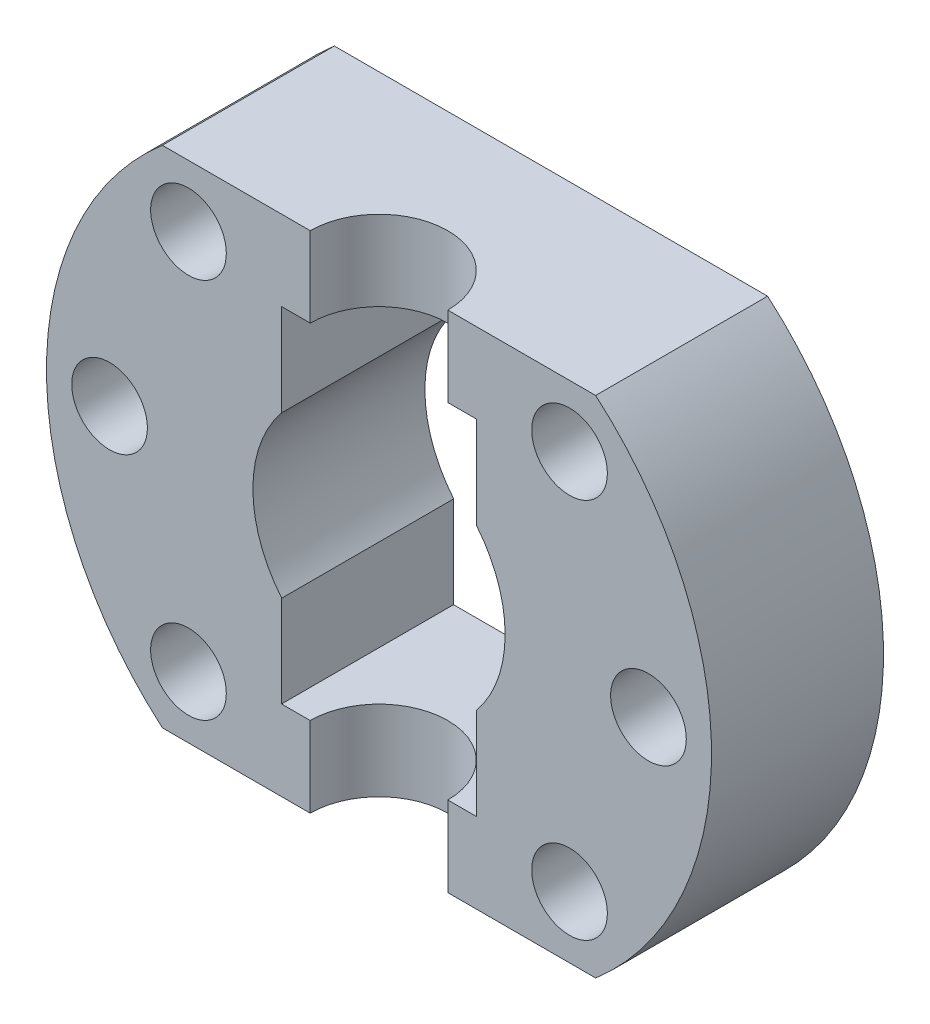
ISO-10303-21;
HEADER;
FILE_DESCRIPTION(('STEP AP214'),'2;1');
FILE_NAME('part.step','',(''),(''),'','','');
FILE_SCHEMA(('AUTOMOTIVE_DESIGN { 1 0 10303 214 1 1 1 1 }'));
ENDSEC;
DATA;
#1=APPLICATION_CONTEXT('core data for automotive mechanical design processes');
#2=APPLICATION_PROTOCOL_DEFINITION('international standard','automotive_design',2000,#1);
#3=PRODUCT_CONTEXT('',#1,'mechanical');
#4=PRODUCT('Part','Part','',(#3));
#5=PRODUCT_RELATED_PRODUCT_CATEGORY('part','',(#4));
#6=PRODUCT_DEFINITION_FORMATION('','',#4);
#7=PRODUCT_DEFINITION_CONTEXT('part definition',#1,'design');
#8=PRODUCT_DEFINITION('design','',#6,#7);
#9=PRODUCT_DEFINITION_SHAPE('','',#8);
#10=(LENGTH_UNIT() NAMED_UNIT(*) SI_UNIT(.MILLI.,.METRE.));
#11=(NAMED_UNIT(*) PLANE_ANGLE_UNIT() SI_UNIT($,.RADIAN.));
#12=(NAMED_UNIT(*) SI_UNIT($,.STERADIAN.) SOLID_ANGLE_UNIT());
#13=UNCERTAINTY_MEASURE_WITH_UNIT(LENGTH_MEASURE(1.E-05),#10,'distance_accuracy_value','');
#14=(GEOMETRIC_REPRESENTATION_CONTEXT(3) GLOBAL_UNCERTAINTY_ASSIGNED_CONTEXT((#13)) GLOBAL_UNIT_ASSIGNED_CONTEXT((#10,
#11,#12)) REPRESENTATION_CONTEXT('',''));
#15=CARTESIAN_POINT('',(0.,0.,0.));
#16=DIRECTION('',(0.,0.,1.));
#17=DIRECTION('',(1.,0.,0.));
#18=AXIS2_PLACEMENT_3D('',#15,#16,#17);
#19=CARTESIAN_POINT('',(0.,0.,15.));
#20=DIRECTION('',(0.,0.,1.));
#21=DIRECTION('',(1.,0.,0.));
#22=AXIS2_PLACEMENT_3D('',#19,#20,#21);
#23=PLANE('',#22);
#24=DIRECTION('',(0.,-1.,0.));
#25=VECTOR('',#24,1.);
#26=CARTESIAN_POINT('',(-6.00000000000001,22.,15.));
#27=LINE('',#26,#25);
#28=CARTESIAN_POINT('',(-6.00000000000001,22.,15.));
#29=VERTEX_POINT('',#28);
#30=CARTESIAN_POINT('',(-6.00000000000001,15.0178799781155,15.));
#31=VERTEX_POINT('',#30);
#32=EDGE_CURVE('E53',#29,#31,#27,.T.);
#33=ORIENTED_EDGE('',*,*,#32,.F.);
#34=DIRECTION('',(-1.,0.,0.));
#35=VECTOR('',#34,1.);
#36=CARTESIAN_POINT('',(-18.8944436276912,22.,15.));
#37=LINE('',#36,#35);
#38=CARTESIAN_POINT('',(-18.8944436276912,22.,15.));
#39=VERTEX_POINT('',#38);
#40=EDGE_CURVE('E176',#29,#39,#37,.T.);
#41=ORIENTED_EDGE('',*,*,#40,.T.);
#42=CARTESIAN_POINT('',(0.,0.,15.));
#43=DIRECTION('',(0.,0.,1.));
#44=DIRECTION('',(1.,0.,0.));
#45=AXIS2_PLACEMENT_3D('',#42,#43,#44);
#46=CIRCLE('',#45,29.);
#47=CARTESIAN_POINT('',(-18.8944436276912,-22.,15.));
#48=VERTEX_POINT('',#47);
#49=EDGE_CURVE('E201',#39,#48,#46,.T.);
#50=ORIENTED_EDGE('',*,*,#49,.T.);
#51=DIRECTION('',(1.,0.,0.));
#52=VECTOR('',#51,1.);
#53=CARTESIAN_POINT('',(-18.8944436276912,-22.,15.));
#54=LINE('',#53,#52);
#55=CARTESIAN_POINT('',(-6.00000000000001,-22.,15.));
#56=VERTEX_POINT('',#55);
#57=EDGE_CURVE('E250',#48,#56,#54,.T.);
#58=ORIENTED_EDGE('',*,*,#57,.T.);
#59=CARTESIAN_POINT('',(-6.00000000000001,-15.,15.));
#60=VERTEX_POINT('',#59);
#61=EDGE_CURVE('E276',#60,#56,#27,.T.);
#62=ORIENTED_EDGE('',*,*,#61,.F.);
#63=DIRECTION('',(1.,0.,0.));
#64=VECTOR('',#63,1.);
#65=CARTESIAN_POINT('',(-8.49999999999999,-15.,15.));
#66=LINE('',#65,#64);
#67=CARTESIAN_POINT('',(-8.49999999999999,-15.,15.));
#68=VERTEX_POINT('',#67);
#69=EDGE_CURVE('E380',#68,#60,#66,.T.);
#70=ORIENTED_EDGE('',*,*,#69,.F.);
#71=DIRECTION('',(0.,-1.,0.));
#72=VECTOR('',#71,1.);
#73=CARTESIAN_POINT('',(-8.49999999999999,-7.,15.));
#74=LINE('',#73,#72);
#75=CARTESIAN_POINT('',(-8.49999999999999,-7.,15.));
#76=VERTEX_POINT('',#75);
#77=EDGE_CURVE('E378',#76,#68,#74,.T.);
#78=ORIENTED_EDGE('',*,*,#77,.F.);
#79=DIRECTION('',(1.,0.,0.));
#80=VECTOR('',#79,1.);
#81=CARTESIAN_POINT('',(-8.49999999999999,-7.,15.));
#82=LINE('',#81,#80);
#83=CARTESIAN_POINT('',(-8.48528137423857,-7.,15.));
#84=VERTEX_POINT('',#83);
#85=EDGE_CURVE('E369',#76,#84,#82,.T.);
#86=ORIENTED_EDGE('',*,*,#85,.T.);
#87=CARTESIAN_POINT('',(0.,0.,15.));
#88=DIRECTION('',(0.,0.,1.));
#89=DIRECTION('',(1.,0.,0.));
#90=AXIS2_PLACEMENT_3D('',#87,#88,#89);
#91=CIRCLE('',#90,11.);
#92=CARTESIAN_POINT('',(-8.5,6.98212002188447,15.));
#93=VERTEX_POINT('',#92);
#94=EDGE_CURVE('E221',#93,#84,#91,.T.);
#95=ORIENTED_EDGE('',*,*,#94,.F.);
#96=DIRECTION('',(0.,-1.,0.));
#97=VECTOR('',#96,1.);
#98=CARTESIAN_POINT('',(-8.5,15.0178799781155,15.));
#99=LINE('',#98,#97);
#100=CARTESIAN_POINT('',(-8.5,15.0178799781155,15.));
#101=VERTEX_POINT('',#100);
#102=EDGE_CURVE('E382',#101,#93,#99,.T.);
#103=ORIENTED_EDGE('',*,*,#102,.F.);
#104=DIRECTION('',(1.,0.,0.));
#105=VECTOR('',#104,1.);
#106=CARTESIAN_POINT('',(-8.5,15.0178799781155,15.));
#107=LINE('',#106,#105);
#108=EDGE_CURVE('E273',#101,#31,#107,.T.);
#109=ORIENTED_EDGE('',*,*,#108,.T.);
#110=EDGE_LOOP('',(#33,#41,#50,#58,#62,#70,#78,#86,#95,#103,#109));
#111=FACE_BOUND('',#110,.T.);
#112=CARTESIAN_POINT('',(-16.6170093578839,-16.6170093578839,15.));
#113=DIRECTION('',(0.,0.,1.));
#114=DIRECTION('',(1.,0.,0.));
#115=AXIS2_PLACEMENT_3D('',#112,#113,#114);
#116=CIRCLE('',#115,3.29999999999986);
#117=CARTESIAN_POINT('',(-13.317009357884,-16.6170093578839,15.));
#118=VERTEX_POINT('',#117);
#119=EDGE_CURVE('E417',#118,#118,#116,.T.);
#120=ORIENTED_EDGE('',*,*,#119,.F.);
#121=EDGE_LOOP('',(#120));
#122=FACE_BOUND('',#121,.T.);
#123=CARTESIAN_POINT('',(-16.6170093578838,16.6170093578839,15.));
#124=DIRECTION('',(0.,0.,1.));
#125=DIRECTION('',(1.,0.,0.));
#126=AXIS2_PLACEMENT_3D('',#123,#124,#125);
#127=CIRCLE('',#126,3.3);
#128=CARTESIAN_POINT('',(-13.3170093578838,16.6170093578839,15.));
#129=VERTEX_POINT('',#128);
#130=EDGE_CURVE('E240',#129,#129,#127,.T.);
#131=ORIENTED_EDGE('',*,*,#130,.F.);
#132=EDGE_LOOP('',(#131));
#133=FACE_BOUND('',#132,.T.);
#134=CARTESIAN_POINT('',(-23.5,0.,15.));
#135=DIRECTION('',(0.,0.,1.));
#136=DIRECTION('',(1.,0.,0.));
#137=AXIS2_PLACEMENT_3D('',#134,#135,#136);
#138=CIRCLE('',#137,3.3);
#139=CARTESIAN_POINT('',(-20.2,0.,15.));
#140=VERTEX_POINT('',#139);
#141=EDGE_CURVE('E196',#140,#140,#138,.T.);
#142=ORIENTED_EDGE('',*,*,#141,.F.);
#143=EDGE_LOOP('',(#142));
#144=FACE_BOUND('',#143,.T.);
#145=ADVANCED_FACE('F38',(#111,#122,#133,#144),#23,.T.);
#146=DIRECTION('',(0.,-1.,0.));
#147=VECTOR('',#146,1.);
#148=CARTESIAN_POINT('',(5.99999999999999,22.,15.));
#149=LINE('',#148,#147);
#150=CARTESIAN_POINT('',(5.99999999999999,-22.,15.));
#151=VERTEX_POINT('',#150);
#152=CARTESIAN_POINT('',(5.99999999999999,-15.,15.));
#153=VERTEX_POINT('',#152);
#154=EDGE_CURVE('E61',#151,#153,#149,.F.);
#155=ORIENTED_EDGE('',*,*,#154,.F.);
#156=CARTESIAN_POINT('',(18.8944436276912,-22.,15.));
#157=VERTEX_POINT('',#156);
#158=EDGE_CURVE('E249',#151,#157,#54,.T.);
#159=ORIENTED_EDGE('',*,*,#158,.T.);
#160=CARTESIAN_POINT('',(0.,0.,15.));
#161=DIRECTION('',(0.,0.,1.));
#162=DIRECTION('',(1.,0.,0.));
#163=AXIS2_PLACEMENT_3D('',#160,#161,#162);
#164=CIRCLE('',#163,29.);
#165=CARTESIAN_POINT('',(18.8944436276912,22.,15.));
#166=VERTEX_POINT('',#165);
#167=EDGE_CURVE('E182',#157,#166,#164,.T.);
#168=ORIENTED_EDGE('',*,*,#167,.T.);
#169=CARTESIAN_POINT('',(5.99999999999999,22.,15.));
#170=VERTEX_POINT('',#169);
#171=EDGE_CURVE('E174',#166,#170,#37,.T.);
#172=ORIENTED_EDGE('',*,*,#171,.T.);
#173=CARTESIAN_POINT('',(5.99999999999999,15.0178799781155,15.));
#174=VERTEX_POINT('',#173);
#175=EDGE_CURVE('E160',#174,#170,#149,.F.);
#176=ORIENTED_EDGE('',*,*,#175,.F.);
#177=CARTESIAN_POINT('',(8.5,15.0178799781155,15.));
#178=VERTEX_POINT('',#177);
#179=EDGE_CURVE('E410',#174,#178,#107,.T.);
#180=ORIENTED_EDGE('',*,*,#179,.T.);
#181=DIRECTION('',(0.,-1.,0.));
#182=VECTOR('',#181,1.);
#183=CARTESIAN_POINT('',(8.5,15.0178799781155,15.));
#184=LINE('',#183,#182);
#185=CARTESIAN_POINT('',(8.5,6.98212002188447,15.));
#186=VERTEX_POINT('',#185);
#187=EDGE_CURVE('E385',#178,#186,#184,.T.);
#188=ORIENTED_EDGE('',*,*,#187,.T.);
#189=CARTESIAN_POINT('',(8.48528137423857,-7.,15.));
#190=VERTEX_POINT('',#189);
#191=EDGE_CURVE('E234',#190,#186,#91,.T.);
#192=ORIENTED_EDGE('',*,*,#191,.F.);
#193=CARTESIAN_POINT('',(8.5,-7.,15.));
#194=VERTEX_POINT('',#193);
#195=EDGE_CURVE('E374',#190,#194,#82,.T.);
#196=ORIENTED_EDGE('',*,*,#195,.T.);
#197=DIRECTION('',(0.,-1.,0.));
#198=VECTOR('',#197,1.);
#199=CARTESIAN_POINT('',(8.5,-7.,15.));
#200=LINE('',#199,#198);
#201=CARTESIAN_POINT('',(8.50000000000001,-15.,15.));
#202=VERTEX_POINT('',#201);
#203=EDGE_CURVE('E390',#194,#202,#200,.T.);
#204=ORIENTED_EDGE('',*,*,#203,.T.);
#205=EDGE_CURVE('E381',#153,#202,#66,.T.);
#206=ORIENTED_EDGE('',*,*,#205,.F.);
#207=EDGE_LOOP('',(#155,#159,#168,#172,#176,#180,#188,#192,#196,#204,#206));
#208=FACE_BOUND('',#207,.T.);
#209=CARTESIAN_POINT('',(16.6170093578837,-16.617009357884,15.));
#210=DIRECTION('',(0.,0.,1.));
#211=DIRECTION('',(1.,0.,0.));
#212=AXIS2_PLACEMENT_3D('',#209,#210,#211);
#213=CIRCLE('',#212,3.3);
#214=CARTESIAN_POINT('',(19.9170093578837,-16.617009357884,15.));
#215=VERTEX_POINT('',#214);
#216=EDGE_CURVE('E423',#215,#215,#213,.T.);
#217=ORIENTED_EDGE('',*,*,#216,.F.);
#218=EDGE_LOOP('',(#217));
#219=FACE_BOUND('',#218,.T.);
#220=CARTESIAN_POINT('',(16.617009357884,16.6170093578838,15.));
#221=DIRECTION('',(0.,0.,1.));
#222=DIRECTION('',(1.,0.,0.));
#223=AXIS2_PLACEMENT_3D('',#220,#221,#222);
#224=CIRCLE('',#223,3.3);
#225=CARTESIAN_POINT('',(19.917009357884,16.6170093578838,15.));
#226=VERTEX_POINT('',#225);
#227=EDGE_CURVE('E435',#226,#226,#224,.T.);
#228=ORIENTED_EDGE('',*,*,#227,.F.);
#229=EDGE_LOOP('',(#228));
#230=FACE_BOUND('',#229,.T.);
#231=CARTESIAN_POINT('',(23.5,-1.64099622925627E-13,15.));
#232=DIRECTION('',(0.,0.,1.));
#233=DIRECTION('',(1.,0.,0.));
#234=AXIS2_PLACEMENT_3D('',#231,#232,#233);
#235=CIRCLE('',#234,3.3);
#236=CARTESIAN_POINT('',(26.8,-1.64099622925627E-13,15.));
#237=VERTEX_POINT('',#236);
#238=EDGE_CURVE('E429',#237,#237,#235,.T.);
#239=ORIENTED_EDGE('',*,*,#238,.F.);
#240=EDGE_LOOP('',(#239));
#241=FACE_BOUND('',#240,.T.);
#242=ADVANCED_FACE('F179',(#208,#219,#230,#241),#23,.T.);
#243=CARTESIAN_POINT('',(0.,0.,0.));
#244=DIRECTION('',(0.,0.,1.));
#245=DIRECTION('',(1.,0.,0.));
#246=AXIS2_PLACEMENT_3D('',#243,#244,#245);
#247=PLANE('',#246);
#248=CARTESIAN_POINT('',(-16.6170093578839,-16.6170093578839,0.));
#249=DIRECTION('',(0.,0.,1.));
#250=DIRECTION('',(1.,0.,0.));
#251=AXIS2_PLACEMENT_3D('',#248,#249,#250);
#252=CIRCLE('',#251,3.29999999999986);
#253=CARTESIAN_POINT('',(-13.317009357884,-16.6170093578839,0.));
#254=VERTEX_POINT('',#253);
#255=EDGE_CURVE('E394',#254,#254,#252,.T.);
#256=ORIENTED_EDGE('',*,*,#255,.T.);
#257=EDGE_LOOP('',(#256));
#258=FACE_BOUND('',#257,.T.);
#259=CARTESIAN_POINT('',(16.6170093578837,-16.617009357884,0.));
#260=DIRECTION('',(0.,0.,1.));
#261=DIRECTION('',(1.,0.,0.));
#262=AXIS2_PLACEMENT_3D('',#259,#260,#261);
#263=CIRCLE('',#262,3.3);
#264=CARTESIAN_POINT('',(19.9170093578837,-16.617009357884,0.));
#265=VERTEX_POINT('',#264);
#266=EDGE_CURVE('E420',#265,#265,#263,.T.);
#267=ORIENTED_EDGE('',*,*,#266,.T.);
#268=EDGE_LOOP('',(#267));
#269=FACE_BOUND('',#268,.T.);
#270=CARTESIAN_POINT('',(23.5,-1.64099622925627E-13,0.));
#271=DIRECTION('',(0.,0.,1.));
#272=DIRECTION('',(1.,0.,0.));
#273=AXIS2_PLACEMENT_3D('',#270,#271,#272);
#274=CIRCLE('',#273,3.3);
#275=CARTESIAN_POINT('',(26.8,-1.64099622925627E-13,0.));
#276=VERTEX_POINT('',#275);
#277=EDGE_CURVE('E426',#276,#276,#274,.T.);
#278=ORIENTED_EDGE('',*,*,#277,.T.);
#279=EDGE_LOOP('',(#278));
#280=FACE_BOUND('',#279,.T.);
#281=CARTESIAN_POINT('',(16.617009357884,16.6170093578838,0.));
#282=DIRECTION('',(0.,0.,1.));
#283=DIRECTION('',(1.,0.,0.));
#284=AXIS2_PLACEMENT_3D('',#281,#282,#283);
#285=CIRCLE('',#284,3.3);
#286=CARTESIAN_POINT('',(19.917009357884,16.6170093578838,0.));
#287=VERTEX_POINT('',#286);
#288=EDGE_CURVE('E432',#287,#287,#285,.T.);
#289=ORIENTED_EDGE('',*,*,#288,.T.);
#290=EDGE_LOOP('',(#289));
#291=FACE_BOUND('',#290,.T.);
#292=CARTESIAN_POINT('',(-16.6170093578838,16.6170093578839,0.));
#293=DIRECTION('',(0.,0.,1.));
#294=DIRECTION('',(1.,0.,0.));
#295=AXIS2_PLACEMENT_3D('',#292,#293,#294);
#296=CIRCLE('',#295,3.3);
#297=CARTESIAN_POINT('',(-13.3170093578838,16.6170093578839,0.));
#298=VERTEX_POINT('',#297);
#299=EDGE_CURVE('E438',#298,#298,#296,.T.);
#300=ORIENTED_EDGE('',*,*,#299,.T.);
#301=EDGE_LOOP('',(#300));
#302=FACE_BOUND('',#301,.T.);
#303=CARTESIAN_POINT('',(-23.5,0.,0.));
#304=DIRECTION('',(0.,0.,1.));
#305=DIRECTION('',(1.,0.,0.));
#306=AXIS2_PLACEMENT_3D('',#303,#304,#305);
#307=CIRCLE('',#306,3.3);
#308=CARTESIAN_POINT('',(-20.2,0.,0.));
#309=VERTEX_POINT('',#308);
#310=EDGE_CURVE('E245',#309,#309,#307,.T.);
#311=ORIENTED_EDGE('',*,*,#310,.T.);
#312=EDGE_LOOP('',(#311));
#313=FACE_BOUND('',#312,.T.);
#314=CARTESIAN_POINT('',(0.,0.,0.));
#315=DIRECTION('',(0.,0.,1.));
#316=DIRECTION('',(1.,0.,0.));
#317=AXIS2_PLACEMENT_3D('',#314,#315,#316);
#318=CIRCLE('',#317,29.);
#319=CARTESIAN_POINT('',(-18.8944436276912,22.,0.));
#320=VERTEX_POINT('',#319);
#321=CARTESIAN_POINT('',(-18.8944436276912,-22.,0.));
#322=VERTEX_POINT('',#321);
#323=EDGE_CURVE('E192',#320,#322,#318,.T.);
#324=ORIENTED_EDGE('',*,*,#323,.F.);
#325=DIRECTION('',(-1.,0.,0.));
#326=VECTOR('',#325,1.);
#327=CARTESIAN_POINT('',(-18.8944436276912,22.,0.));
#328=LINE('',#327,#326);
#329=CARTESIAN_POINT('',(18.8944436276912,22.,0.));
#330=VERTEX_POINT('',#329);
#331=EDGE_CURVE('E200',#330,#320,#328,.T.);
#332=ORIENTED_EDGE('',*,*,#331,.F.);
#333=CARTESIAN_POINT('',(0.,0.,0.));
#334=DIRECTION('',(0.,0.,1.));
#335=DIRECTION('',(1.,0.,0.));
#336=AXIS2_PLACEMENT_3D('',#333,#334,#335);
#337=CIRCLE('',#336,29.);
#338=CARTESIAN_POINT('',(18.8944436276912,-22.,0.));
#339=VERTEX_POINT('',#338);
#340=EDGE_CURVE('E198',#339,#330,#337,.T.);
#341=ORIENTED_EDGE('',*,*,#340,.F.);
#342=DIRECTION('',(1.,0.,0.));
#343=VECTOR('',#342,1.);
#344=CARTESIAN_POINT('',(-18.8944436276912,-22.,0.));
#345=LINE('',#344,#343);
#346=EDGE_CURVE('E195',#322,#339,#345,.T.);
#347=ORIENTED_EDGE('',*,*,#346,.F.);
#348=EDGE_LOOP('',(#324,#332,#341,#347));
#349=FACE_BOUND('',#348,.T.);
#350=DIRECTION('',(1.,0.,0.));
#351=VECTOR('',#350,1.);
#352=CARTESIAN_POINT('',(-8.49999999999999,-7.,0.));
#353=LINE('',#352,#351);
#354=CARTESIAN_POINT('',(-8.49999999999999,-7.,0.));
#355=VERTEX_POINT('',#354);
#356=CARTESIAN_POINT('',(-8.48528137423857,-7.,0.));
#357=VERTEX_POINT('',#356);
#358=EDGE_CURVE('E230',#355,#357,#353,.T.);
#359=ORIENTED_EDGE('',*,*,#358,.F.);
#360=DIRECTION('',(0.,-1.,0.));
#361=VECTOR('',#360,1.);
#362=CARTESIAN_POINT('',(-8.49999999999999,-7.,0.));
#363=LINE('',#362,#361);
#364=CARTESIAN_POINT('',(-8.49999999999999,-15.,0.));
#365=VERTEX_POINT('',#364);
#366=EDGE_CURVE('E373',#355,#365,#363,.T.);
#367=ORIENTED_EDGE('',*,*,#366,.T.);
#368=DIRECTION('',(1.,0.,0.));
#369=VECTOR('',#368,1.);
#370=CARTESIAN_POINT('',(-8.49999999999999,-15.,0.));
#371=LINE('',#370,#369);
#372=CARTESIAN_POINT('',(8.50000000000001,-15.,0.));
#373=VERTEX_POINT('',#372);
#374=EDGE_CURVE('E619',#365,#373,#371,.T.);
#375=ORIENTED_EDGE('',*,*,#374,.T.);
#376=DIRECTION('',(0.,-1.,0.));
#377=VECTOR('',#376,1.);
#378=CARTESIAN_POINT('',(8.5,-7.,0.));
#379=LINE('',#378,#377);
#380=CARTESIAN_POINT('',(8.5,-7.,0.));
#381=VERTEX_POINT('',#380);
#382=EDGE_CURVE('E617',#381,#373,#379,.T.);
#383=ORIENTED_EDGE('',*,*,#382,.F.);
#384=CARTESIAN_POINT('',(8.48528137423857,-7.,0.));
#385=VERTEX_POINT('',#384);
#386=EDGE_CURVE('E615',#385,#381,#353,.T.);
#387=ORIENTED_EDGE('',*,*,#386,.F.);
#388=CARTESIAN_POINT('',(0.,0.,0.));
#389=DIRECTION('',(0.,0.,1.));
#390=DIRECTION('',(1.,0.,0.));
#391=AXIS2_PLACEMENT_3D('',#388,#389,#390);
#392=CIRCLE('',#391,11.);
#393=CARTESIAN_POINT('',(8.5,6.98212002188447,0.));
#394=VERTEX_POINT('',#393);
#395=EDGE_CURVE('E235',#385,#394,#392,.T.);
#396=ORIENTED_EDGE('',*,*,#395,.T.);
#397=DIRECTION('',(0.,-1.,0.));
#398=VECTOR('',#397,1.);
#399=CARTESIAN_POINT('',(8.5,15.0178799781155,0.));
#400=LINE('',#399,#398);
#401=CARTESIAN_POINT('',(8.5,15.0178799781155,0.));
#402=VERTEX_POINT('',#401);
#403=EDGE_CURVE('E414',#402,#394,#400,.T.);
#404=ORIENTED_EDGE('',*,*,#403,.F.);
#405=DIRECTION('',(1.,0.,0.));
#406=VECTOR('',#405,1.);
#407=CARTESIAN_POINT('',(-8.5,15.0178799781155,0.));
#408=LINE('',#407,#406);
#409=CARTESIAN_POINT('',(-8.5,15.0178799781155,0.));
#410=VERTEX_POINT('',#409);
#411=EDGE_CURVE('E404',#410,#402,#408,.T.);
#412=ORIENTED_EDGE('',*,*,#411,.F.);
#413=DIRECTION('',(0.,-1.,0.));
#414=VECTOR('',#413,1.);
#415=CARTESIAN_POINT('',(-8.5,15.0178799781155,0.));
#416=LINE('',#415,#414);
#417=CARTESIAN_POINT('',(-8.5,6.98212002188447,0.));
#418=VERTEX_POINT('',#417);
#419=EDGE_CURVE('E233',#410,#418,#416,.T.);
#420=ORIENTED_EDGE('',*,*,#419,.T.);
#421=EDGE_CURVE('E219',#418,#357,#392,.T.);
#422=ORIENTED_EDGE('',*,*,#421,.T.);
#423=EDGE_LOOP('',(#359,#367,#375,#383,#387,#396,#404,#412,#420,#422));
#424=FACE_BOUND('',#423,.T.);
#425=ADVANCED_FACE('F228',(#258,#269,#280,#291,#302,#313,#349,#424),#247,.F.);
#426=CARTESIAN_POINT('',(0.,0.,15.));
#427=DIRECTION('',(0.,0.,-1.));
#428=DIRECTION('',(-1.,0.,0.));
#429=AXIS2_PLACEMENT_3D('',#426,#427,#428);
#430=CYLINDRICAL_SURFACE('',#429,11.);
#431=ORIENTED_EDGE('',*,*,#94,.T.);
#432=DIRECTION('',(0.,0.,-1.));
#433=VECTOR('',#432,1.);
#434=CARTESIAN_POINT('',(-8.48528137423857,-7.,15.));
#435=LINE('',#434,#433);
#436=EDGE_CURVE('E46',#84,#357,#435,.T.);
#437=ORIENTED_EDGE('',*,*,#436,.T.);
#438=ORIENTED_EDGE('',*,*,#421,.F.);
#439=DIRECTION('',(0.,0.,1.));
#440=VECTOR('',#439,1.);
#441=CARTESIAN_POINT('',(-8.5,6.98212002188447,0.));
#442=LINE('',#441,#440);
#443=EDGE_CURVE('E402',#418,#93,#442,.T.);
#444=ORIENTED_EDGE('',*,*,#443,.T.);
#445=EDGE_LOOP('',(#431,#437,#438,#444));
#446=FACE_BOUND('',#445,.T.);
#447=ADVANCED_FACE('F217',(#446),#430,.F.);
#448=ORIENTED_EDGE('',*,*,#395,.F.);
#449=DIRECTION('',(0.,0.,-1.));
#450=VECTOR('',#449,1.);
#451=CARTESIAN_POINT('',(8.48528137423857,-7.,15.));
#452=LINE('',#451,#450);
#453=EDGE_CURVE('E210',#385,#190,#452,.F.);
#454=ORIENTED_EDGE('',*,*,#453,.T.);
#455=ORIENTED_EDGE('',*,*,#191,.T.);
#456=DIRECTION('',(0.,0.,1.));
#457=VECTOR('',#456,1.);
#458=CARTESIAN_POINT('',(8.5,6.98212002188447,0.));
#459=LINE('',#458,#457);
#460=EDGE_CURVE('E405',#394,#186,#459,.T.);
#461=ORIENTED_EDGE('',*,*,#460,.F.);
#462=EDGE_LOOP('',(#448,#454,#455,#461));
#463=FACE_BOUND('',#462,.T.);
#464=ADVANCED_FACE('F312',(#463),#430,.F.);
#465=CARTESIAN_POINT('',(0.,0.,15.));
#466=DIRECTION('',(0.,0.,-1.));
#467=DIRECTION('',(-1.,0.,0.));
#468=AXIS2_PLACEMENT_3D('',#465,#466,#467);
#469=CYLINDRICAL_SURFACE('',#468,29.);
#470=ORIENTED_EDGE('',*,*,#323,.T.);
#471=DIRECTION('',(0.,0.,-1.));
#472=VECTOR('',#471,1.);
#473=CARTESIAN_POINT('',(-18.8944436276912,-22.,15.));
#474=LINE('',#473,#472);
#475=EDGE_CURVE('E207',#48,#322,#474,.T.);
#476=ORIENTED_EDGE('',*,*,#475,.F.);
#477=ORIENTED_EDGE('',*,*,#49,.F.);
#478=DIRECTION('',(0.,0.,-1.));
#479=VECTOR('',#478,1.);
#480=CARTESIAN_POINT('',(-18.8944436276912,22.,15.));
#481=LINE('',#480,#479);
#482=EDGE_CURVE('E184',#39,#320,#481,.T.);
#483=ORIENTED_EDGE('',*,*,#482,.T.);
#484=EDGE_LOOP('',(#470,#476,#477,#483));
#485=FACE_BOUND('',#484,.T.);
#486=ADVANCED_FACE('F40',(#485),#469,.T.);
#487=CARTESIAN_POINT('',(-18.8944436276912,-22.,15.));
#488=DIRECTION('',(0.,1.,0.));
#489=DIRECTION('',(0.,0.,1.));
#490=AXIS2_PLACEMENT_3D('',#487,#488,#489);
#491=PLANE('',#490);
#492=ORIENTED_EDGE('',*,*,#158,.F.);
#493=CARTESIAN_POINT('',(0.,-22.,15.));
#494=DIRECTION('',(0.,-1.,0.));
#495=DIRECTION('',(0.,0.,-1.));
#496=AXIS2_PLACEMENT_3D('',#493,#494,#495);
#497=CIRCLE('',#496,6.);
#498=EDGE_CURVE('E177',#56,#151,#497,.T.);
#499=ORIENTED_EDGE('',*,*,#498,.F.);
#500=ORIENTED_EDGE('',*,*,#57,.F.);
#501=ORIENTED_EDGE('',*,*,#475,.T.);
#502=ORIENTED_EDGE('',*,*,#346,.T.);
#503=DIRECTION('',(0.,0.,-1.));
#504=VECTOR('',#503,1.);
#505=CARTESIAN_POINT('',(18.8944436276912,-22.,15.));
#506=LINE('',#505,#504);
#507=EDGE_CURVE('E204',#157,#339,#506,.T.);
#508=ORIENTED_EDGE('',*,*,#507,.F.);
#509=EDGE_LOOP('',(#492,#499,#500,#501,#502,#508));
#510=FACE_BOUND('',#509,.T.);
#511=ADVANCED_FACE('F259',(#510),#491,.F.);
#512=CARTESIAN_POINT('',(0.,0.,15.));
#513=DIRECTION('',(0.,0.,-1.));
#514=DIRECTION('',(-1.,0.,0.));
#515=AXIS2_PLACEMENT_3D('',#512,#513,#514);
#516=CYLINDRICAL_SURFACE('',#515,29.);
#517=ORIENTED_EDGE('',*,*,#340,.T.);
#518=DIRECTION('',(0.,0.,-1.));
#519=VECTOR('',#518,1.);
#520=CARTESIAN_POINT('',(18.8944436276912,22.,15.));
#521=LINE('',#520,#519);
#522=EDGE_CURVE('E187',#166,#330,#521,.T.);
#523=ORIENTED_EDGE('',*,*,#522,.F.);
#524=ORIENTED_EDGE('',*,*,#167,.F.);
#525=ORIENTED_EDGE('',*,*,#507,.T.);
#526=EDGE_LOOP('',(#517,#523,#524,#525));
#527=FACE_BOUND('',#526,.T.);
#528=ADVANCED_FACE('F262',(#527),#516,.T.);
#529=CARTESIAN_POINT('',(-18.8944436276912,22.,15.));
#530=DIRECTION('',(0.,-1.,0.));
#531=DIRECTION('',(0.,0.,-1.));
#532=AXIS2_PLACEMENT_3D('',#529,#530,#531);
#533=PLANE('',#532);
#534=ORIENTED_EDGE('',*,*,#40,.F.);
#535=CARTESIAN_POINT('',(0.,22.,15.));
#536=DIRECTION('',(0.,-1.,0.));
#537=DIRECTION('',(0.,0.,-1.));
#538=AXIS2_PLACEMENT_3D('',#535,#536,#537);
#539=CIRCLE('',#538,6.);
#540=EDGE_CURVE('E163',#29,#170,#539,.T.);
#541=ORIENTED_EDGE('',*,*,#540,.T.);
#542=ORIENTED_EDGE('',*,*,#171,.F.);
#543=ORIENTED_EDGE('',*,*,#522,.T.);
#544=ORIENTED_EDGE('',*,*,#331,.T.);
#545=ORIENTED_EDGE('',*,*,#482,.F.);
#546=EDGE_LOOP('',(#534,#541,#542,#543,#544,#545));
#547=FACE_BOUND('',#546,.T.);
#548=ADVANCED_FACE('F172',(#547),#533,.F.);
#549=CARTESIAN_POINT('',(-23.5,0.,15.));
#550=DIRECTION('',(0.,0.,-1.));
#551=DIRECTION('',(-1.,0.,0.));
#552=AXIS2_PLACEMENT_3D('',#549,#550,#551);
#553=CYLINDRICAL_SURFACE('',#552,3.3);
#554=ORIENTED_EDGE('',*,*,#141,.T.);
#555=EDGE_LOOP('',(#554));
#556=FACE_BOUND('',#555,.T.);
#557=ORIENTED_EDGE('',*,*,#310,.F.);
#558=EDGE_LOOP('',(#557));
#559=FACE_BOUND('',#558,.T.);
#560=ADVANCED_FACE('F300',(#556,#559),#553,.F.);
#561=CARTESIAN_POINT('',(-16.6170093578838,16.6170093578839,15.));
#562=DIRECTION('',(0.,0.,-1.));
#563=DIRECTION('',(-1.,0.,0.));
#564=AXIS2_PLACEMENT_3D('',#561,#562,#563);
#565=CYLINDRICAL_SURFACE('',#564,3.3);
#566=ORIENTED_EDGE('',*,*,#130,.T.);
#567=EDGE_LOOP('',(#566));
#568=FACE_BOUND('',#567,.T.);
#569=ORIENTED_EDGE('',*,*,#299,.F.);
#570=EDGE_LOOP('',(#569));
#571=FACE_BOUND('',#570,.T.);
#572=ADVANCED_FACE('F322',(#568,#571),#565,.F.);
#573=CARTESIAN_POINT('',(16.617009357884,16.6170093578838,15.));
#574=DIRECTION('',(0.,0.,-1.));
#575=DIRECTION('',(-1.,0.,0.));
#576=AXIS2_PLACEMENT_3D('',#573,#574,#575);
#577=CYLINDRICAL_SURFACE('',#576,3.3);
#578=ORIENTED_EDGE('',*,*,#227,.T.);
#579=EDGE_LOOP('',(#578));
#580=FACE_BOUND('',#579,.T.);
#581=ORIENTED_EDGE('',*,*,#288,.F.);
#582=EDGE_LOOP('',(#581));
#583=FACE_BOUND('',#582,.T.);
#584=ADVANCED_FACE('F325',(#580,#583),#577,.F.);
#585=CARTESIAN_POINT('',(23.5,-1.64099622925627E-13,15.));
#586=DIRECTION('',(0.,0.,-1.));
#587=DIRECTION('',(-1.,0.,0.));
#588=AXIS2_PLACEMENT_3D('',#585,#586,#587);
#589=CYLINDRICAL_SURFACE('',#588,3.3);
#590=ORIENTED_EDGE('',*,*,#238,.T.);
#591=EDGE_LOOP('',(#590));
#592=FACE_BOUND('',#591,.T.);
#593=ORIENTED_EDGE('',*,*,#277,.F.);
#594=EDGE_LOOP('',(#593));
#595=FACE_BOUND('',#594,.T.);
#596=ADVANCED_FACE('F329',(#592,#595),#589,.F.);
#597=CARTESIAN_POINT('',(16.6170093578837,-16.617009357884,15.));
#598=DIRECTION('',(0.,0.,-1.));
#599=DIRECTION('',(-1.,0.,0.));
#600=AXIS2_PLACEMENT_3D('',#597,#598,#599);
#601=CYLINDRICAL_SURFACE('',#600,3.3);
#602=ORIENTED_EDGE('',*,*,#216,.T.);
#603=EDGE_LOOP('',(#602));
#604=FACE_BOUND('',#603,.T.);
#605=ORIENTED_EDGE('',*,*,#266,.F.);
#606=EDGE_LOOP('',(#605));
#607=FACE_BOUND('',#606,.T.);
#608=ADVANCED_FACE('F333',(#604,#607),#601,.F.);
#609=CARTESIAN_POINT('',(-16.6170093578839,-16.6170093578839,15.));
#610=DIRECTION('',(0.,0.,-1.));
#611=DIRECTION('',(-1.,0.,0.));
#612=AXIS2_PLACEMENT_3D('',#609,#610,#611);
#613=CYLINDRICAL_SURFACE('',#612,3.29999999999986);
#614=ORIENTED_EDGE('',*,*,#119,.T.);
#615=EDGE_LOOP('',(#614));
#616=FACE_BOUND('',#615,.T.);
#617=ORIENTED_EDGE('',*,*,#255,.F.);
#618=EDGE_LOOP('',(#617));
#619=FACE_BOUND('',#618,.T.);
#620=ADVANCED_FACE('F337',(#616,#619),#613,.F.);
#621=CARTESIAN_POINT('',(-8.5,15.0178799781155,0.));
#622=DIRECTION('',(-1.,0.,0.));
#623=DIRECTION('',(0.,0.,1.));
#624=AXIS2_PLACEMENT_3D('',#621,#622,#623);
#625=PLANE('',#624);
#626=ORIENTED_EDGE('',*,*,#102,.T.);
#627=ORIENTED_EDGE('',*,*,#443,.F.);
#628=ORIENTED_EDGE('',*,*,#419,.F.);
#629=DIRECTION('',(0.,0.,1.));
#630=VECTOR('',#629,1.);
#631=CARTESIAN_POINT('',(-8.5,15.0178799781155,0.));
#632=LINE('',#631,#630);
#633=EDGE_CURVE('E274',#410,#101,#632,.T.);
#634=ORIENTED_EDGE('',*,*,#633,.T.);
#635=EDGE_LOOP('',(#626,#627,#628,#634));
#636=FACE_BOUND('',#635,.T.);
#637=ADVANCED_FACE('F341',(#636),#625,.F.);
#638=CARTESIAN_POINT('',(-8.5,15.0178799781155,0.));
#639=DIRECTION('',(0.,-1.,0.));
#640=DIRECTION('',(0.,0.,-1.));
#641=AXIS2_PLACEMENT_3D('',#638,#639,#640);
#642=PLANE('',#641);
#643=CARTESIAN_POINT('',(0.,15.0178799781155,15.));
#644=DIRECTION('',(0.,-1.,0.));
#645=DIRECTION('',(0.,0.,-1.));
#646=AXIS2_PLACEMENT_3D('',#643,#644,#645);
#647=CIRCLE('',#646,6.);
#648=EDGE_CURVE('E164',#31,#174,#647,.T.);
#649=ORIENTED_EDGE('',*,*,#648,.F.);
#650=ORIENTED_EDGE('',*,*,#108,.F.);
#651=ORIENTED_EDGE('',*,*,#633,.F.);
#652=ORIENTED_EDGE('',*,*,#411,.T.);
#653=DIRECTION('',(0.,0.,1.));
#654=VECTOR('',#653,1.);
#655=CARTESIAN_POINT('',(8.5,15.0178799781155,0.));
#656=LINE('',#655,#654);
#657=EDGE_CURVE('E277',#402,#178,#656,.T.);
#658=ORIENTED_EDGE('',*,*,#657,.T.);
#659=ORIENTED_EDGE('',*,*,#179,.F.);
#660=EDGE_LOOP('',(#649,#650,#651,#652,#658,#659));
#661=FACE_BOUND('',#660,.T.);
#662=ADVANCED_FACE('F343',(#661),#642,.T.);
#663=CARTESIAN_POINT('',(8.5,15.0178799781155,0.));
#664=DIRECTION('',(-1.,0.,0.));
#665=DIRECTION('',(0.,0.,1.));
#666=AXIS2_PLACEMENT_3D('',#663,#664,#665);
#667=PLANE('',#666);
#668=ORIENTED_EDGE('',*,*,#187,.F.);
#669=ORIENTED_EDGE('',*,*,#657,.F.);
#670=ORIENTED_EDGE('',*,*,#403,.T.);
#671=ORIENTED_EDGE('',*,*,#460,.T.);
#672=EDGE_LOOP('',(#668,#669,#670,#671));
#673=FACE_BOUND('',#672,.T.);
#674=ADVANCED_FACE('F346',(#673),#667,.T.);
#675=CARTESIAN_POINT('',(-8.49999999999999,-7.,0.));
#676=DIRECTION('',(0.,-1.,0.));
#677=DIRECTION('',(0.,0.,-1.));
#678=AXIS2_PLACEMENT_3D('',#675,#676,#677);
#679=PLANE('',#678);
#680=ORIENTED_EDGE('',*,*,#85,.F.);
#681=DIRECTION('',(0.,0.,1.));
#682=VECTOR('',#681,1.);
#683=CARTESIAN_POINT('',(-8.49999999999999,-7.,0.));
#684=LINE('',#683,#682);
#685=EDGE_CURVE('E371',#355,#76,#684,.T.);
#686=ORIENTED_EDGE('',*,*,#685,.F.);
#687=ORIENTED_EDGE('',*,*,#358,.T.);
#688=ORIENTED_EDGE('',*,*,#436,.F.);
#689=EDGE_LOOP('',(#680,#686,#687,#688));
#690=FACE_BOUND('',#689,.T.);
#691=ADVANCED_FACE('F350',(#690),#679,.T.);
#692=CARTESIAN_POINT('',(-8.49999999999999,-7.,0.));
#693=DIRECTION('',(-1.,0.,0.));
#694=DIRECTION('',(0.,0.,1.));
#695=AXIS2_PLACEMENT_3D('',#692,#693,#694);
#696=PLANE('',#695);
#697=ORIENTED_EDGE('',*,*,#77,.T.);
#698=DIRECTION('',(0.,0.,1.));
#699=VECTOR('',#698,1.);
#700=CARTESIAN_POINT('',(-8.49999999999999,-15.,0.));
#701=LINE('',#700,#699);
#702=EDGE_CURVE('E400',#365,#68,#701,.T.);
#703=ORIENTED_EDGE('',*,*,#702,.F.);
#704=ORIENTED_EDGE('',*,*,#366,.F.);
#705=ORIENTED_EDGE('',*,*,#685,.T.);
#706=EDGE_LOOP('',(#697,#703,#704,#705));
#707=FACE_BOUND('',#706,.T.);
#708=ADVANCED_FACE('F355',(#707),#696,.F.);
#709=ORIENTED_EDGE('',*,*,#386,.T.);
#710=DIRECTION('',(0.,0.,1.));
#711=VECTOR('',#710,1.);
#712=CARTESIAN_POINT('',(8.5,-7.,0.));
#713=LINE('',#712,#711);
#714=EDGE_CURVE('E395',#381,#194,#713,.T.);
#715=ORIENTED_EDGE('',*,*,#714,.T.);
#716=ORIENTED_EDGE('',*,*,#195,.F.);
#717=ORIENTED_EDGE('',*,*,#453,.F.);
#718=EDGE_LOOP('',(#709,#715,#716,#717));
#719=FACE_BOUND('',#718,.T.);
#720=ADVANCED_FACE('F357',(#719),#679,.T.);
#721=CARTESIAN_POINT('',(8.5,-7.,0.));
#722=DIRECTION('',(-1.,0.,0.));
#723=DIRECTION('',(0.,-1.,0.));
#724=AXIS2_PLACEMENT_3D('',#721,#722,#723);
#725=PLANE('',#724);
#726=ORIENTED_EDGE('',*,*,#203,.F.);
#727=ORIENTED_EDGE('',*,*,#714,.F.);
#728=ORIENTED_EDGE('',*,*,#382,.T.);
#729=DIRECTION('',(0.,0.,1.));
#730=VECTOR('',#729,1.);
#731=CARTESIAN_POINT('',(8.50000000000001,-15.,0.));
#732=LINE('',#731,#730);
#733=EDGE_CURVE('E397',#373,#202,#732,.T.);
#734=ORIENTED_EDGE('',*,*,#733,.T.);
#735=EDGE_LOOP('',(#726,#727,#728,#734));
#736=FACE_BOUND('',#735,.T.);
#737=ADVANCED_FACE('F289',(#736),#725,.T.);
#738=CARTESIAN_POINT('',(-8.49999999999999,-15.,0.));
#739=DIRECTION('',(0.,-1.,0.));
#740=DIRECTION('',(0.,0.,-1.));
#741=AXIS2_PLACEMENT_3D('',#738,#739,#740);
#742=PLANE('',#741);
#743=ORIENTED_EDGE('',*,*,#69,.T.);
#744=CARTESIAN_POINT('',(0.,-15.,15.));
#745=DIRECTION('',(0.,-1.,0.));
#746=DIRECTION('',(0.,0.,-1.));
#747=AXIS2_PLACEMENT_3D('',#744,#745,#746);
#748=CIRCLE('',#747,6.);
#749=EDGE_CURVE('E11',#60,#153,#748,.T.);
#750=ORIENTED_EDGE('',*,*,#749,.T.);
#751=ORIENTED_EDGE('',*,*,#205,.T.);
#752=ORIENTED_EDGE('',*,*,#733,.F.);
#753=ORIENTED_EDGE('',*,*,#374,.F.);
#754=ORIENTED_EDGE('',*,*,#702,.T.);
#755=EDGE_LOOP('',(#743,#750,#751,#752,#753,#754));
#756=FACE_BOUND('',#755,.T.);
#757=ADVANCED_FACE('F283',(#756),#742,.F.);
#758=CARTESIAN_POINT('',(0.,22.,15.));
#759=DIRECTION('',(0.,-1.,0.));
#760=DIRECTION('',(0.,0.,-1.));
#761=AXIS2_PLACEMENT_3D('',#758,#759,#760);
#762=CYLINDRICAL_SURFACE('',#761,6.);
#763=ORIENTED_EDGE('',*,*,#61,.T.);
#764=ORIENTED_EDGE('',*,*,#498,.T.);
#765=ORIENTED_EDGE('',*,*,#154,.T.);
#766=ORIENTED_EDGE('',*,*,#749,.F.);
#767=EDGE_LOOP('',(#763,#764,#765,#766));
#768=FACE_BOUND('',#767,.T.);
#769=ADVANCED_FACE('F281',(#768),#762,.F.);
#770=ORIENTED_EDGE('',*,*,#32,.T.);
#771=ORIENTED_EDGE('',*,*,#648,.T.);
#772=ORIENTED_EDGE('',*,*,#175,.T.);
#773=ORIENTED_EDGE('',*,*,#540,.F.);
#774=EDGE_LOOP('',(#770,#771,#772,#773));
#775=FACE_BOUND('',#774,.T.);
#776=ADVANCED_FACE('F162',(#775),#762,.F.);
#777=CLOSED_SHELL('',(#145,#242,#425,#447,#464,#486,#511,#528,#548,#560,#572,#584,#596,#608,
#620,#637,#662,#674,#691,#708,#720,#737,#757,#769,#776));
#778=MANIFOLD_SOLID_BREP('B2',#777);
#779=ADVANCED_BREP_SHAPE_REPRESENTATION('',(#18,#778),#14);
#780=SHAPE_DEFINITION_REPRESENTATION(#9,#779);
ENDSEC;
END-ISO-10303-21;
